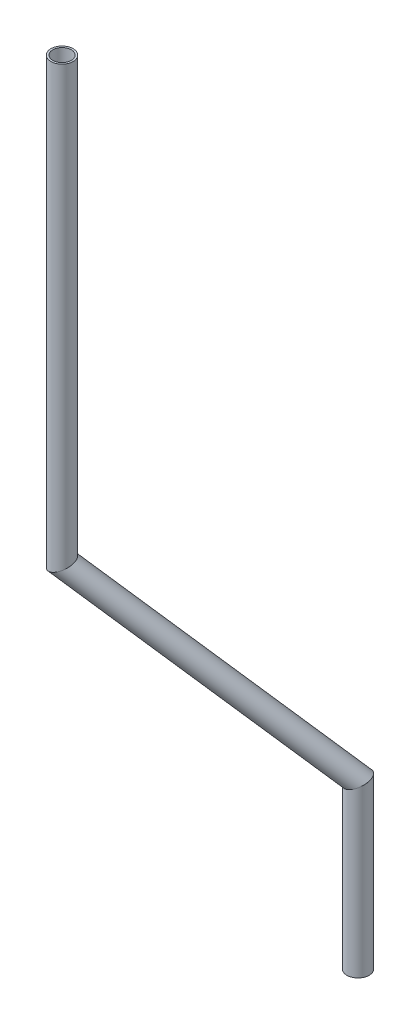
ISO-10303-21;
HEADER;
FILE_DESCRIPTION(('STEP AP214'),'2;1');
FILE_NAME('part.step','',(''),(''),'','','');
FILE_SCHEMA(('AUTOMOTIVE_DESIGN { 1 0 10303 214 1 1 1 1 }'));
ENDSEC;
DATA;
#1=APPLICATION_CONTEXT('core data for automotive mechanical design processes');
#2=APPLICATION_PROTOCOL_DEFINITION('international standard','automotive_design',2000,#1);
#3=PRODUCT_CONTEXT('',#1,'mechanical');
#4=PRODUCT('Part','Part','',(#3));
#5=PRODUCT_RELATED_PRODUCT_CATEGORY('part','',(#4));
#6=PRODUCT_DEFINITION_FORMATION('','',#4);
#7=PRODUCT_DEFINITION_CONTEXT('part definition',#1,'design');
#8=PRODUCT_DEFINITION('design','',#6,#7);
#9=PRODUCT_DEFINITION_SHAPE('','',#8);
#10=(LENGTH_UNIT() NAMED_UNIT(*) SI_UNIT(.MILLI.,.METRE.));
#11=(NAMED_UNIT(*) PLANE_ANGLE_UNIT() SI_UNIT($,.RADIAN.));
#12=(NAMED_UNIT(*) SI_UNIT($,.STERADIAN.) SOLID_ANGLE_UNIT());
#13=UNCERTAINTY_MEASURE_WITH_UNIT(LENGTH_MEASURE(1.E-05),#10,'distance_accuracy_value','');
#14=(GEOMETRIC_REPRESENTATION_CONTEXT(3) GLOBAL_UNCERTAINTY_ASSIGNED_CONTEXT((#13)) GLOBAL_UNIT_ASSIGNED_CONTEXT((#10,
#11,#12)) REPRESENTATION_CONTEXT('',''));
#15=CARTESIAN_POINT('',(0.,0.,0.));
#16=DIRECTION('',(0.,0.,1.));
#17=DIRECTION('',(1.,0.,0.));
#18=AXIS2_PLACEMENT_3D('',#15,#16,#17);
#19=CARTESIAN_POINT('',(-436.190807932509,574.21193659315,450.405195917529));
#20=DIRECTION('',(0.,1.,0.));
#21=DIRECTION('',(0.,0.,1.));
#22=AXIS2_PLACEMENT_3D('',#19,#20,#21);
#23=CYLINDRICAL_SURFACE('',#22,5.28319999999999);
#24=CARTESIAN_POINT('',(-436.190807932509,824.623396557858,450.405195917529));
#25=DIRECTION('',(0.,-1.,0.));
#26=DIRECTION('',(0.,0.,-1.));
#27=AXIS2_PLACEMENT_3D('',#24,#25,#26);
#28=CIRCLE('',#27,5.28319999999999);
#29=CARTESIAN_POINT('',(-436.190807932509,824.623396557858,445.121995917529));
#30=VERTEX_POINT('',#29);
#31=EDGE_CURVE('E55',#30,#30,#28,.T.);
#32=ORIENTED_EDGE('',*,*,#31,.F.);
#33=EDGE_LOOP('',(#32));
#34=FACE_BOUND('',#33,.T.);
#35=CARTESIAN_POINT('',(-436.190807932509,574.21193659315,450.405195917529));
#36=DIRECTION('',(0.309943518200429,-0.908952901052853,-0.27881829063593));
#37=DIRECTION('',(0.675761236302539,0.416898817061889,-0.607899767924994));
#38=AXIS2_PLACEMENT_3D('',#35,#36,#37);
#39=ELLIPSE('',#38,5.81240237407283,5.28319999999999);
#40=CARTESIAN_POINT('',(-432.263011718318,576.635120267188,446.871837863244));
#41=VERTEX_POINT('',#40);
#42=EDGE_CURVE('E51',#41,#41,#39,.T.);
#43=ORIENTED_EDGE('',*,*,#42,.T.);
#44=EDGE_LOOP('',(#43));
#45=FACE_BOUND('',#44,.T.);
#46=ADVANCED_FACE('F47',(#34,#45),#23,.F.);
#47=CARTESIAN_POINT('',(-436.190807932509,574.21193659315,450.405195917529));
#48=DIRECTION('',(0.,1.,0.));
#49=DIRECTION('',(0.,0.,1.));
#50=AXIS2_PLACEMENT_3D('',#47,#48,#49);
#51=CYLINDRICAL_SURFACE('',#50,6.34999999999999);
#52=CARTESIAN_POINT('',(-436.190807932509,824.623396557858,450.405195917529));
#53=DIRECTION('',(0.,-1.,0.));
#54=DIRECTION('',(0.,0.,-1.));
#55=AXIS2_PLACEMENT_3D('',#52,#53,#54);
#56=CIRCLE('',#55,6.34999999999999);
#57=CARTESIAN_POINT('',(-436.190807932509,824.623396557858,444.055195917529));
#58=VERTEX_POINT('',#57);
#59=EDGE_CURVE('E59',#58,#58,#56,.T.);
#60=ORIENTED_EDGE('',*,*,#59,.T.);
#61=EDGE_LOOP('',(#60));
#62=FACE_BOUND('',#61,.T.);
#63=CARTESIAN_POINT('',(-436.190807932509,574.21193659315,450.405195917529));
#64=DIRECTION('',(0.309943518200429,-0.908952901052853,-0.27881829063593));
#65=DIRECTION('',(0.675761236302539,0.416898817061889,-0.607899767924994));
#66=AXIS2_PLACEMENT_3D('',#63,#64,#65);
#67=ELLIPSE('',#66,6.98606054576062,6.34999999999999);
#68=CARTESIAN_POINT('',(-431.469899021221,577.1244169706,446.158371333052));
#69=VERTEX_POINT('',#68);
#70=EDGE_CURVE('E12',#69,#69,#67,.T.);
#71=ORIENTED_EDGE('',*,*,#70,.F.);
#72=EDGE_LOOP('',(#71));
#73=FACE_BOUND('',#72,.T.);
#74=ADVANCED_FACE('F74',(#62,#73),#51,.T.);
#75=CARTESIAN_POINT('',(-436.190807932509,824.623396557858,450.405195917529));
#76=DIRECTION('',(0.,-1.,0.));
#77=DIRECTION('',(0.,0.,-1.));
#78=AXIS2_PLACEMENT_3D('',#75,#76,#77);
#79=PLANE('',#78);
#80=ORIENTED_EDGE('',*,*,#31,.T.);
#81=EDGE_LOOP('',(#80));
#82=FACE_BOUND('',#81,.T.);
#83=ORIENTED_EDGE('',*,*,#59,.F.);
#84=EDGE_LOOP('',(#83));
#85=FACE_BOUND('',#84,.T.);
#86=ADVANCED_FACE('F70',(#82,#85),#79,.F.);
#87=CARTESIAN_POINT('',(-436.190807932509,574.21193659315,450.405195917529));
#88=DIRECTION('',(0.309943518200429,-0.908952901052853,-0.27881829063593));
#89=DIRECTION('',(0.946486902717923,0.322742223738128,0.));
#90=AXIS2_PLACEMENT_3D('',#87,#88,#89);
#91=PLANE('',#90);
#92=ORIENTED_EDGE('',*,*,#42,.F.);
#93=EDGE_LOOP('',(#92));
#94=FACE_BOUND('',#93,.T.);
#95=ORIENTED_EDGE('',*,*,#70,.T.);
#96=EDGE_LOOP('',(#95));
#97=FACE_BOUND('',#96,.T.);
#98=ADVANCED_FACE('F49',(#94,#97),#91,.T.);
#99=CLOSED_SHELL('',(#46,#74,#86,#98));
#100=MANIFOLD_SOLID_BREP('B2',#99);
#101=CARTESIAN_POINT('',(-347.274493823372,471.259811951229,370.418058733634));
#102=DIRECTION('',(-0.563448120061616,0.652390752664796,0.506865388280253));
#103=DIRECTION('',(-0.756811678240822,-0.653632988517494,0.));
#104=AXIS2_PLACEMENT_3D('',#101,#102,#103);
#105=CYLINDRICAL_SURFACE('',#104,5.28319999999999);
#106=CARTESIAN_POINT('',(-347.274493823372,471.259811951229,370.418058733634));
#107=DIRECTION('',(0.309943518200429,-0.908952901052853,-0.278818290635931));
#108=DIRECTION('',(-0.675761236302539,-0.416898817061889,0.607899767924994));
#109=AXIS2_PLACEMENT_3D('',#106,#107,#108);
#110=ELLIPSE('',#109,5.81240237407283,5.28319999999999);
#111=CARTESIAN_POINT('',(-351.202290037564,468.836628277191,373.951416787919));
#112=VERTEX_POINT('',#111);
#113=EDGE_CURVE('E150',#112,#112,#110,.T.);
#114=ORIENTED_EDGE('',*,*,#113,.T.);
#115=EDGE_LOOP('',(#114));
#116=FACE_BOUND('',#115,.T.);
#117=CARTESIAN_POINT('',(-436.190807932509,574.21193659315,450.405195917529));
#118=DIRECTION('',(-0.309943518200429,0.908952901052853,0.278818290635931));
#119=DIRECTION('',(-0.675761236302539,-0.416898817061889,0.607899767924994));
#120=AXIS2_PLACEMENT_3D('',#117,#118,#119);
#121=ELLIPSE('',#120,5.81240237407283,5.28319999999999);
#122=CARTESIAN_POINT('',(-440.1186041467,571.788752919111,453.938553971815));
#123=VERTEX_POINT('',#122);
#124=EDGE_CURVE('E140',#123,#123,#121,.T.);
#125=ORIENTED_EDGE('',*,*,#124,.T.);
#126=EDGE_LOOP('',(#125));
#127=FACE_BOUND('',#126,.T.);
#128=ADVANCED_FACE('F136',(#116,#127),#105,.F.);
#129=CARTESIAN_POINT('',(-347.274493823372,471.259811951229,370.418058733634));
#130=DIRECTION('',(-0.563448120061616,0.652390752664796,0.506865388280253));
#131=DIRECTION('',(-0.756811678240822,-0.653632988517494,0.));
#132=AXIS2_PLACEMENT_3D('',#129,#130,#131);
#133=CYLINDRICAL_SURFACE('',#132,6.34999999999999);
#134=CARTESIAN_POINT('',(-347.274493823372,471.259811951229,370.418058733634));
#135=DIRECTION('',(0.309943518200429,-0.908952901052853,-0.278818290635931));
#136=DIRECTION('',(-0.675761236302539,-0.416898817061889,0.607899767924994));
#137=AXIS2_PLACEMENT_3D('',#134,#135,#136);
#138=ELLIPSE('',#137,6.98606054576062,6.34999999999999);
#139=CARTESIAN_POINT('',(-351.99540273466,468.347331573779,374.664883318112));
#140=VERTEX_POINT('',#139);
#141=EDGE_CURVE('E144',#140,#140,#138,.T.);
#142=ORIENTED_EDGE('',*,*,#141,.F.);
#143=EDGE_LOOP('',(#142));
#144=FACE_BOUND('',#143,.T.);
#145=CARTESIAN_POINT('',(-436.190807932509,574.21193659315,450.405195917529));
#146=DIRECTION('',(-0.309943518200429,0.908952901052853,0.278818290635931));
#147=DIRECTION('',(-0.675761236302539,-0.416898817061889,0.607899767924994));
#148=AXIS2_PLACEMENT_3D('',#145,#146,#147);
#149=ELLIPSE('',#148,6.98606054576062,6.34999999999999);
#150=CARTESIAN_POINT('',(-440.911716843797,571.299456215699,454.652020502007));
#151=VERTEX_POINT('',#150);
#152=EDGE_CURVE('E46',#151,#151,#149,.T.);
#153=ORIENTED_EDGE('',*,*,#152,.F.);
#154=EDGE_LOOP('',(#153));
#155=FACE_BOUND('',#154,.T.);
#156=ADVANCED_FACE('F163',(#144,#155),#133,.T.);
#157=CARTESIAN_POINT('',(-347.274493823372,471.259811951229,370.418058733634));
#158=DIRECTION('',(0.309943518200429,-0.908952901052853,-0.278818290635931));
#159=DIRECTION('',(0.946486902717923,0.322742223738128,0.));
#160=AXIS2_PLACEMENT_3D('',#157,#158,#159);
#161=PLANE('',#160);
#162=ORIENTED_EDGE('',*,*,#113,.F.);
#163=EDGE_LOOP('',(#162));
#164=FACE_BOUND('',#163,.T.);
#165=ORIENTED_EDGE('',*,*,#141,.T.);
#166=EDGE_LOOP('',(#165));
#167=FACE_BOUND('',#166,.T.);
#168=ADVANCED_FACE('F159',(#164,#167),#161,.T.);
#169=CARTESIAN_POINT('',(-436.190807932509,574.21193659315,450.405195917529));
#170=DIRECTION('',(-0.309943518200429,0.908952901052853,0.278818290635931));
#171=DIRECTION('',(-0.946486902717923,-0.322742223738128,0.));
#172=AXIS2_PLACEMENT_3D('',#169,#170,#171);
#173=PLANE('',#172);
#174=ORIENTED_EDGE('',*,*,#124,.F.);
#175=EDGE_LOOP('',(#174));
#176=FACE_BOUND('',#175,.T.);
#177=ORIENTED_EDGE('',*,*,#152,.T.);
#178=EDGE_LOOP('',(#177));
#179=FACE_BOUND('',#178,.T.);
#180=ADVANCED_FACE('F138',(#176,#179),#173,.T.);
#181=CLOSED_SHELL('',(#128,#156,#168,#180));
#182=MANIFOLD_SOLID_BREP('B7',#181);
#183=CARTESIAN_POINT('',(-347.274493823372,377.466050092134,370.418058733634));
#184=DIRECTION('',(0.,1.,0.));
#185=DIRECTION('',(0.,0.,1.));
#186=AXIS2_PLACEMENT_3D('',#183,#184,#185);
#187=CYLINDRICAL_SURFACE('',#186,5.28319999999999);
#188=CARTESIAN_POINT('',(-347.274493823372,377.466050092134,370.418058733634));
#189=DIRECTION('',(0.,-1.,0.));
#190=DIRECTION('',(0.,0.,-1.));
#191=AXIS2_PLACEMENT_3D('',#188,#189,#190);
#192=CIRCLE('',#191,5.28319999999999);
#193=CARTESIAN_POINT('',(-347.274493823372,377.466050092134,365.134858733634));
#194=VERTEX_POINT('',#193);
#195=EDGE_CURVE('E234',#194,#194,#192,.T.);
#196=ORIENTED_EDGE('',*,*,#195,.T.);
#197=EDGE_LOOP('',(#196));
#198=FACE_BOUND('',#197,.T.);
#199=CARTESIAN_POINT('',(-347.274493823372,471.259811951229,370.418058733634));
#200=DIRECTION('',(-0.309943518200429,0.908952901052853,0.27881829063593));
#201=DIRECTION('',(0.675761236302539,0.416898817061889,-0.607899767924994));
#202=AXIS2_PLACEMENT_3D('',#199,#200,#201);
#203=ELLIPSE('',#202,5.81240237407283,5.28319999999999);
#204=CARTESIAN_POINT('',(-343.346697609181,473.682995625268,366.884700679348));
#205=VERTEX_POINT('',#204);
#206=EDGE_CURVE('E224',#205,#205,#203,.T.);
#207=ORIENTED_EDGE('',*,*,#206,.T.);
#208=EDGE_LOOP('',(#207));
#209=FACE_BOUND('',#208,.T.);
#210=ADVANCED_FACE('F220',(#198,#209),#187,.F.);
#211=CARTESIAN_POINT('',(-347.274493823372,377.466050092134,370.418058733634));
#212=DIRECTION('',(0.,1.,0.));
#213=DIRECTION('',(0.,0.,1.));
#214=AXIS2_PLACEMENT_3D('',#211,#212,#213);
#215=CYLINDRICAL_SURFACE('',#214,6.34999999999999);
#216=CARTESIAN_POINT('',(-347.274493823372,377.466050092134,370.418058733634));
#217=DIRECTION('',(0.,-1.,0.));
#218=DIRECTION('',(0.,0.,-1.));
#219=AXIS2_PLACEMENT_3D('',#216,#217,#218);
#220=CIRCLE('',#219,6.34999999999999);
#221=CARTESIAN_POINT('',(-347.274493823372,377.466050092134,364.068058733634));
#222=VERTEX_POINT('',#221);
#223=EDGE_CURVE('E228',#222,#222,#220,.T.);
#224=ORIENTED_EDGE('',*,*,#223,.F.);
#225=EDGE_LOOP('',(#224));
#226=FACE_BOUND('',#225,.T.);
#227=CARTESIAN_POINT('',(-347.274493823372,471.259811951229,370.418058733634));
#228=DIRECTION('',(-0.309943518200429,0.908952901052853,0.27881829063593));
#229=DIRECTION('',(0.675761236302539,0.416898817061889,-0.607899767924994));
#230=AXIS2_PLACEMENT_3D('',#227,#228,#229);
#231=ELLIPSE('',#230,6.98606054576062,6.34999999999999);
#232=CARTESIAN_POINT('',(-342.553584912085,474.17229232868,366.171234149156));
#233=VERTEX_POINT('',#232);
#234=EDGE_CURVE('E135',#233,#233,#231,.T.);
#235=ORIENTED_EDGE('',*,*,#234,.F.);
#236=EDGE_LOOP('',(#235));
#237=FACE_BOUND('',#236,.T.);
#238=ADVANCED_FACE('F247',(#226,#237),#215,.T.);
#239=CARTESIAN_POINT('',(-347.274493823372,377.466050092134,370.418058733634));
#240=DIRECTION('',(0.,-1.,0.));
#241=DIRECTION('',(0.,0.,-1.));
#242=AXIS2_PLACEMENT_3D('',#239,#240,#241);
#243=PLANE('',#242);
#244=ORIENTED_EDGE('',*,*,#195,.F.);
#245=EDGE_LOOP('',(#244));
#246=FACE_BOUND('',#245,.T.);
#247=ORIENTED_EDGE('',*,*,#223,.T.);
#248=EDGE_LOOP('',(#247));
#249=FACE_BOUND('',#248,.T.);
#250=ADVANCED_FACE('F243',(#246,#249),#243,.T.);
#251=CARTESIAN_POINT('',(-347.274493823372,471.259811951229,370.418058733634));
#252=DIRECTION('',(-0.309943518200429,0.908952901052853,0.27881829063593));
#253=DIRECTION('',(-0.946486902717923,-0.322742223738128,0.));
#254=AXIS2_PLACEMENT_3D('',#251,#252,#253);
#255=PLANE('',#254);
#256=ORIENTED_EDGE('',*,*,#206,.F.);
#257=EDGE_LOOP('',(#256));
#258=FACE_BOUND('',#257,.T.);
#259=ORIENTED_EDGE('',*,*,#234,.T.);
#260=EDGE_LOOP('',(#259));
#261=FACE_BOUND('',#260,.T.);
#262=ADVANCED_FACE('F222',(#258,#261),#255,.T.);
#263=CLOSED_SHELL('',(#210,#238,#250,#262));
#264=MANIFOLD_SOLID_BREP('B41',#263);
#265=ADVANCED_BREP_SHAPE_REPRESENTATION('',(#18,#100,#182,#264),#14);
#266=SHAPE_DEFINITION_REPRESENTATION(#9,#265);
ENDSEC;
END-ISO-10303-21;
